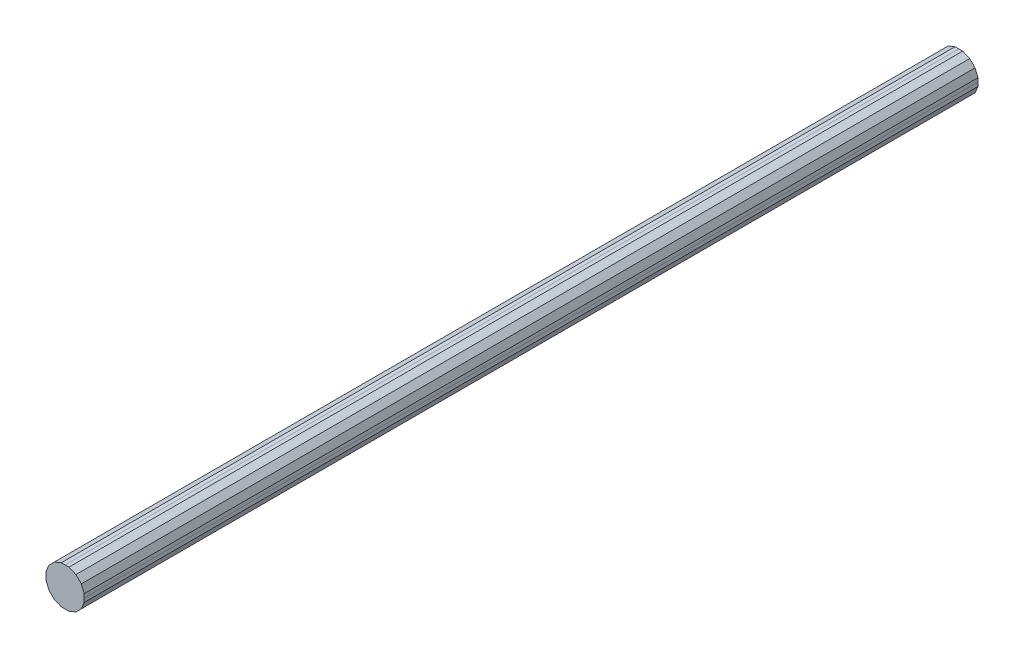
ISO-10303-21;
HEADER;
FILE_DESCRIPTION(('STEP AP214'),'2;1');
FILE_NAME('part.step','',(''),(''),'','','');
FILE_SCHEMA(('AUTOMOTIVE_DESIGN { 1 0 10303 214 1 1 1 1 }'));
ENDSEC;
DATA;
#1=APPLICATION_CONTEXT('core data for automotive mechanical design processes');
#2=APPLICATION_PROTOCOL_DEFINITION('international standard','automotive_design',2000,#1);
#3=PRODUCT_CONTEXT('',#1,'mechanical');
#4=PRODUCT('Part','Part','',(#3));
#5=PRODUCT_RELATED_PRODUCT_CATEGORY('part','',(#4));
#6=PRODUCT_DEFINITION_FORMATION('','',#4);
#7=PRODUCT_DEFINITION_CONTEXT('part definition',#1,'design');
#8=PRODUCT_DEFINITION('design','',#6,#7);
#9=PRODUCT_DEFINITION_SHAPE('','',#8);
#10=(LENGTH_UNIT() NAMED_UNIT(*) SI_UNIT(.MILLI.,.METRE.));
#11=(NAMED_UNIT(*) PLANE_ANGLE_UNIT() SI_UNIT($,.RADIAN.));
#12=(NAMED_UNIT(*) SI_UNIT($,.STERADIAN.) SOLID_ANGLE_UNIT());
#13=UNCERTAINTY_MEASURE_WITH_UNIT(LENGTH_MEASURE(1.E-05),#10,'distance_accuracy_value','');
#14=(GEOMETRIC_REPRESENTATION_CONTEXT(3) GLOBAL_UNCERTAINTY_ASSIGNED_CONTEXT((#13)) GLOBAL_UNIT_ASSIGNED_CONTEXT((#10,
#11,#12)) REPRESENTATION_CONTEXT('',''));
#15=CARTESIAN_POINT('',(0.,0.,0.));
#16=DIRECTION('',(0.,0.,1.));
#17=DIRECTION('',(1.,0.,0.));
#18=AXIS2_PLACEMENT_3D('',#15,#16,#17);
#19=CARTESIAN_POINT('',(0.,-0.2994914,13.99999994));
#20=DIRECTION('',(0.,0.,-1.));
#21=DIRECTION('',(0.,-1.,0.));
#22=AXIS2_PLACEMENT_3D('',#19,#20,#21);
#23=PLANE('',#22);
#24=DIRECTION('',(1.,0.,0.));
#25=VECTOR('',#24,1.);
#26=CARTESIAN_POINT('',(0.,-0.2994914,13.99999994));
#27=LINE('',#26,#25);
#28=CARTESIAN_POINT('',(0.,-0.2994914,13.99999994));
#29=VERTEX_POINT('',#28);
#30=CARTESIAN_POINT('',(0.05957062,-0.2994914,13.99999994));
#31=VERTEX_POINT('',#30);
#32=EDGE_CURVE('E239',#29,#31,#27,.T.);
#33=ORIENTED_EDGE('',*,*,#32,.T.);
#34=DIRECTION('',(0.923885359866117,0.382669363583048,0.));
#35=VECTOR('',#34,1.);
#36=CARTESIAN_POINT('',(0.05957062,-0.2994914,13.99999994));
#37=LINE('',#36,#35);
#38=CARTESIAN_POINT('',(0.1696466,-0.2538984,13.99999994));
#39=VERTEX_POINT('',#38);
#40=EDGE_CURVE('E227',#31,#39,#37,.T.);
#41=ORIENTED_EDGE('',*,*,#40,.T.);
#42=DIRECTION('',(0.707106781186048,0.707106781187048,0.));
#43=VECTOR('',#42,1.);
#44=CARTESIAN_POINT('',(0.1696466,-0.2538984,13.99999994));
#45=LINE('',#44,#43);
#46=CARTESIAN_POINT('',(0.25389586,-0.16964914,13.99999994));
#47=VERTEX_POINT('',#46);
#48=EDGE_CURVE('E269',#39,#47,#45,.T.);
#49=ORIENTED_EDGE('',*,*,#48,.T.);
#50=DIRECTION('',(0.382687560176932,0.923877822704835,0.));
#51=VECTOR('',#50,1.);
#52=CARTESIAN_POINT('',(0.25389586,-0.16964914,13.99999994));
#53=LINE('',#52,#51);
#54=CARTESIAN_POINT('',(0.2994914,-0.05957316,13.99999994));
#55=VERTEX_POINT('',#54);
#56=EDGE_CURVE('E163',#47,#55,#53,.T.);
#57=ORIENTED_EDGE('',*,*,#56,.T.);
#58=DIRECTION('',(0.,1.,0.));
#59=VECTOR('',#58,1.);
#60=CARTESIAN_POINT('',(0.2994914,-0.05957316,13.99999994));
#61=LINE('',#60,#59);
#62=CARTESIAN_POINT('',(0.2994914,0.,13.99999994));
#63=VERTEX_POINT('',#62);
#64=EDGE_CURVE('E317',#55,#63,#61,.T.);
#65=ORIENTED_EDGE('',*,*,#64,.T.);
#66=DIRECTION('',(0.,1.,0.));
#67=VECTOR('',#66,1.);
#68=CARTESIAN_POINT('',(0.2994914,0.,13.99999994));
#69=LINE('',#68,#67);
#70=CARTESIAN_POINT('',(0.2994914,0.05957061999999,13.99999994));
#71=VERTEX_POINT('',#70);
#72=EDGE_CURVE('E318',#63,#71,#69,.T.);
#73=ORIENTED_EDGE('',*,*,#72,.T.);
#74=DIRECTION('',(-0.382687560176932,0.923877822704835,0.));
#75=VECTOR('',#74,1.);
#76=CARTESIAN_POINT('',(0.2994914,0.05957061999999,13.99999994));
#77=LINE('',#76,#75);
#78=CARTESIAN_POINT('',(0.25389586,0.1696466,13.99999994));
#79=VERTEX_POINT('',#78);
#80=EDGE_CURVE('E305',#71,#79,#77,.T.);
#81=ORIENTED_EDGE('',*,*,#80,.T.);
#82=DIRECTION('',(-0.707106781186548,0.707106781186548,0.));
#83=VECTOR('',#82,1.);
#84=CARTESIAN_POINT('',(0.25389586,0.1696466,13.99999994));
#85=LINE('',#84,#83);
#86=CARTESIAN_POINT('',(0.1696466,0.25389586,13.99999994));
#87=VERTEX_POINT('',#86);
#88=EDGE_CURVE('E256',#79,#87,#85,.T.);
#89=ORIENTED_EDGE('',*,*,#88,.T.);
#90=DIRECTION('',(-0.923877822704835,0.382687560176932,0.));
#91=VECTOR('',#90,1.);
#92=CARTESIAN_POINT('',(0.1696466,0.25389586,13.99999994));
#93=LINE('',#92,#91);
#94=CARTESIAN_POINT('',(0.05957062,0.2994914,13.99999994));
#95=VERTEX_POINT('',#94);
#96=EDGE_CURVE('E291',#87,#95,#93,.T.);
#97=ORIENTED_EDGE('',*,*,#96,.T.);
#98=DIRECTION('',(-1.,0.,0.));
#99=VECTOR('',#98,1.);
#100=CARTESIAN_POINT('',(0.05957062,0.2994914,13.99999994));
#101=LINE('',#100,#99);
#102=CARTESIAN_POINT('',(0.,0.2994914,13.99999994));
#103=VERTEX_POINT('',#102);
#104=EDGE_CURVE('E270',#95,#103,#101,.T.);
#105=ORIENTED_EDGE('',*,*,#104,.T.);
#106=DIRECTION('',(-1.,0.,0.));
#107=VECTOR('',#106,1.);
#108=CARTESIAN_POINT('',(0.,0.2994914,13.99999994));
#109=LINE('',#108,#107);
#110=CARTESIAN_POINT('',(-0.05957316,0.2994914,13.99999994));
#111=VERTEX_POINT('',#110);
#112=EDGE_CURVE('E217',#103,#111,#109,.T.);
#113=ORIENTED_EDGE('',*,*,#112,.T.);
#114=DIRECTION('',(-0.923877822704835,-0.382687560176932,0.));
#115=VECTOR('',#114,1.);
#116=CARTESIAN_POINT('',(-0.05957316,0.2994914,13.99999994));
#117=LINE('',#116,#115);
#118=CARTESIAN_POINT('',(-0.16964914,0.25389586,13.99999994));
#119=VERTEX_POINT('',#118);
#120=EDGE_CURVE('E188',#111,#119,#117,.T.);
#121=ORIENTED_EDGE('',*,*,#120,.T.);
#122=DIRECTION('',(-0.707106781187048,-0.707106781186048,0.));
#123=VECTOR('',#122,1.);
#124=CARTESIAN_POINT('',(-0.16964914,0.25389586,13.99999994));
#125=LINE('',#124,#123);
#126=CARTESIAN_POINT('',(-0.2538984,0.1696466,13.99999994));
#127=VERTEX_POINT('',#126);
#128=EDGE_CURVE('E209',#119,#127,#125,.T.);
#129=ORIENTED_EDGE('',*,*,#128,.T.);
#130=DIRECTION('',(-0.382669363583048,-0.923885359866117,0.));
#131=VECTOR('',#130,1.);
#132=CARTESIAN_POINT('',(-0.2538984,0.1696466,13.99999994));
#133=LINE('',#132,#131);
#134=CARTESIAN_POINT('',(-0.2994914,0.05957061999999,13.99999994));
#135=VERTEX_POINT('',#134);
#136=EDGE_CURVE('E286',#127,#135,#133,.T.);
#137=ORIENTED_EDGE('',*,*,#136,.T.);
#138=DIRECTION('',(0.,-1.,0.));
#139=VECTOR('',#138,1.);
#140=CARTESIAN_POINT('',(-0.2994914,0.05957061999999,13.99999994));
#141=LINE('',#140,#139);
#142=CARTESIAN_POINT('',(-0.2994914,0.,13.99999994));
#143=VERTEX_POINT('',#142);
#144=EDGE_CURVE('E383',#135,#143,#141,.T.);
#145=ORIENTED_EDGE('',*,*,#144,.T.);
#146=DIRECTION('',(0.,-1.,0.));
#147=VECTOR('',#146,1.);
#148=CARTESIAN_POINT('',(-0.2994914,0.,13.99999994));
#149=LINE('',#148,#147);
#150=CARTESIAN_POINT('',(-0.2994914,-0.05957316,13.99999994));
#151=VERTEX_POINT('',#150);
#152=EDGE_CURVE('E375',#143,#151,#149,.T.);
#153=ORIENTED_EDGE('',*,*,#152,.T.);
#154=DIRECTION('',(0.382669363583048,-0.923885359866117,0.));
#155=VECTOR('',#154,1.);
#156=CARTESIAN_POINT('',(-0.2994914,-0.05957316,13.99999994));
#157=LINE('',#156,#155);
#158=CARTESIAN_POINT('',(-0.2538984,-0.16964914,13.99999994));
#159=VERTEX_POINT('',#158);
#160=EDGE_CURVE('E280',#151,#159,#157,.T.);
#161=ORIENTED_EDGE('',*,*,#160,.T.);
#162=DIRECTION('',(0.707106781186548,-0.707106781186548,0.));
#163=VECTOR('',#162,1.);
#164=CARTESIAN_POINT('',(-0.2538984,-0.16964914,13.99999994));
#165=LINE('',#164,#163);
#166=CARTESIAN_POINT('',(-0.16964914,-0.2538984,13.99999994));
#167=VERTEX_POINT('',#166);
#168=EDGE_CURVE('E251',#159,#167,#165,.T.);
#169=ORIENTED_EDGE('',*,*,#168,.T.);
#170=DIRECTION('',(0.923885359866117,-0.382669363583048,0.));
#171=VECTOR('',#170,1.);
#172=CARTESIAN_POINT('',(-0.16964914,-0.2538984,13.99999994));
#173=LINE('',#172,#171);
#174=CARTESIAN_POINT('',(-0.05957316,-0.2994914,13.99999994));
#175=VERTEX_POINT('',#174);
#176=EDGE_CURVE('E236',#167,#175,#173,.T.);
#177=ORIENTED_EDGE('',*,*,#176,.T.);
#178=DIRECTION('',(1.,0.,0.));
#179=VECTOR('',#178,1.);
#180=CARTESIAN_POINT('',(-0.05957316,-0.2994914,13.99999994));
#181=LINE('',#180,#179);
#182=EDGE_CURVE('E10',#175,#29,#181,.T.);
#183=ORIENTED_EDGE('',*,*,#182,.T.);
#184=EDGE_LOOP('',(#33,#41,#49,#57,#65,#73,#81,#89,#97,#105,#113,#121,#129,#137,#145,#153,#161,
#169,#177,#183));
#185=FACE_BOUND('',#184,.T.);
#186=ADVANCED_FACE('F16',(#185),#23,.F.);
#187=CARTESIAN_POINT('',(0.,-0.2994914,0.));
#188=DIRECTION('',(0.,0.,-1.));
#189=DIRECTION('',(0.,-1.,0.));
#190=AXIS2_PLACEMENT_3D('',#187,#188,#189);
#191=PLANE('',#190);
#192=DIRECTION('',(1.,0.,0.));
#193=VECTOR('',#192,1.);
#194=CARTESIAN_POINT('',(-0.05957316,-0.2994914,0.));
#195=LINE('',#194,#193);
#196=CARTESIAN_POINT('',(-0.05957316,-0.2994914,0.));
#197=VERTEX_POINT('',#196);
#198=CARTESIAN_POINT('',(0.,-0.2994914,0.));
#199=VERTEX_POINT('',#198);
#200=EDGE_CURVE('E27',#197,#199,#195,.T.);
#201=ORIENTED_EDGE('',*,*,#200,.F.);
#202=DIRECTION('',(0.923885359866117,-0.382669363583048,0.));
#203=VECTOR('',#202,1.);
#204=CARTESIAN_POINT('',(-0.16964914,-0.2538984,0.));
#205=LINE('',#204,#203);
#206=CARTESIAN_POINT('',(-0.16964914,-0.2538984,0.));
#207=VERTEX_POINT('',#206);
#208=EDGE_CURVE('E237',#207,#197,#205,.T.);
#209=ORIENTED_EDGE('',*,*,#208,.F.);
#210=DIRECTION('',(0.707106781186548,-0.707106781186548,0.));
#211=VECTOR('',#210,1.);
#212=CARTESIAN_POINT('',(-0.2538984,-0.16964914,0.));
#213=LINE('',#212,#211);
#214=CARTESIAN_POINT('',(-0.2538984,-0.16964914,0.));
#215=VERTEX_POINT('',#214);
#216=EDGE_CURVE('E276',#215,#207,#213,.T.);
#217=ORIENTED_EDGE('',*,*,#216,.F.);
#218=DIRECTION('',(0.382669363583048,-0.923885359866117,0.));
#219=VECTOR('',#218,1.);
#220=CARTESIAN_POINT('',(-0.2994914,-0.05957316,0.));
#221=LINE('',#220,#219);
#222=CARTESIAN_POINT('',(-0.2994914,-0.05957316,0.));
#223=VERTEX_POINT('',#222);
#224=EDGE_CURVE('E300',#223,#215,#221,.T.);
#225=ORIENTED_EDGE('',*,*,#224,.F.);
#226=DIRECTION('',(0.,-1.,0.));
#227=VECTOR('',#226,1.);
#228=CARTESIAN_POINT('',(-0.2994914,0.,0.));
#229=LINE('',#228,#227);
#230=CARTESIAN_POINT('',(-0.2994914,0.,0.));
#231=VERTEX_POINT('',#230);
#232=EDGE_CURVE('E376',#231,#223,#229,.T.);
#233=ORIENTED_EDGE('',*,*,#232,.F.);
#234=DIRECTION('',(0.,-1.,0.));
#235=VECTOR('',#234,1.);
#236=CARTESIAN_POINT('',(-0.2994914,0.05957061999999,0.));
#237=LINE('',#236,#235);
#238=CARTESIAN_POINT('',(-0.2994914,0.05957061999999,0.));
#239=VERTEX_POINT('',#238);
#240=EDGE_CURVE('E281',#239,#231,#237,.T.);
#241=ORIENTED_EDGE('',*,*,#240,.F.);
#242=DIRECTION('',(-0.382669363583048,-0.923885359866117,0.));
#243=VECTOR('',#242,1.);
#244=CARTESIAN_POINT('',(-0.2538984,0.1696466,0.));
#245=LINE('',#244,#243);
#246=CARTESIAN_POINT('',(-0.2538984,0.1696466,0.));
#247=VERTEX_POINT('',#246);
#248=EDGE_CURVE('E199',#247,#239,#245,.T.);
#249=ORIENTED_EDGE('',*,*,#248,.F.);
#250=DIRECTION('',(-0.707106781187048,-0.707106781186048,0.));
#251=VECTOR('',#250,1.);
#252=CARTESIAN_POINT('',(-0.16964914,0.25389586,0.));
#253=LINE('',#252,#251);
#254=CARTESIAN_POINT('',(-0.16964914,0.25389586,0.));
#255=VERTEX_POINT('',#254);
#256=EDGE_CURVE('E193',#255,#247,#253,.T.);
#257=ORIENTED_EDGE('',*,*,#256,.F.);
#258=DIRECTION('',(-0.923877822704835,-0.382687560176932,0.));
#259=VECTOR('',#258,1.);
#260=CARTESIAN_POINT('',(-0.05957316,0.2994914,0.));
#261=LINE('',#260,#259);
#262=CARTESIAN_POINT('',(-0.05957316,0.2994914,0.));
#263=VERTEX_POINT('',#262);
#264=EDGE_CURVE('E197',#263,#255,#261,.T.);
#265=ORIENTED_EDGE('',*,*,#264,.F.);
#266=DIRECTION('',(-1.,0.,0.));
#267=VECTOR('',#266,1.);
#268=CARTESIAN_POINT('',(0.,0.2994914,0.));
#269=LINE('',#268,#267);
#270=CARTESIAN_POINT('',(0.,0.2994914,0.));
#271=VERTEX_POINT('',#270);
#272=EDGE_CURVE('E274',#271,#263,#269,.T.);
#273=ORIENTED_EDGE('',*,*,#272,.F.);
#274=DIRECTION('',(-1.,0.,0.));
#275=VECTOR('',#274,1.);
#276=CARTESIAN_POINT('',(0.05957062,0.2994914,0.));
#277=LINE('',#276,#275);
#278=CARTESIAN_POINT('',(0.05957062,0.2994914,0.));
#279=VERTEX_POINT('',#278);
#280=EDGE_CURVE('E295',#279,#271,#277,.T.);
#281=ORIENTED_EDGE('',*,*,#280,.F.);
#282=DIRECTION('',(-0.923877822704835,0.382687560176932,0.));
#283=VECTOR('',#282,1.);
#284=CARTESIAN_POINT('',(0.1696466,0.25389586,0.));
#285=LINE('',#284,#283);
#286=CARTESIAN_POINT('',(0.1696466,0.25389586,0.));
#287=VERTEX_POINT('',#286);
#288=EDGE_CURVE('E260',#287,#279,#285,.T.);
#289=ORIENTED_EDGE('',*,*,#288,.F.);
#290=DIRECTION('',(-0.707106781186548,0.707106781186548,0.));
#291=VECTOR('',#290,1.);
#292=CARTESIAN_POINT('',(0.25389586,0.1696466,0.));
#293=LINE('',#292,#291);
#294=CARTESIAN_POINT('',(0.25389586,0.1696466,0.));
#295=VERTEX_POINT('',#294);
#296=EDGE_CURVE('E301',#295,#287,#293,.T.);
#297=ORIENTED_EDGE('',*,*,#296,.F.);
#298=DIRECTION('',(-0.382687560176932,0.923877822704835,0.));
#299=VECTOR('',#298,1.);
#300=CARTESIAN_POINT('',(0.2994914,0.05957061999999,0.));
#301=LINE('',#300,#299);
#302=CARTESIAN_POINT('',(0.2994914,0.05957061999999,0.));
#303=VERTEX_POINT('',#302);
#304=EDGE_CURVE('E322',#303,#295,#301,.T.);
#305=ORIENTED_EDGE('',*,*,#304,.F.);
#306=DIRECTION('',(0.,1.,0.));
#307=VECTOR('',#306,1.);
#308=CARTESIAN_POINT('',(0.2994914,0.,0.));
#309=LINE('',#308,#307);
#310=CARTESIAN_POINT('',(0.2994914,0.,0.));
#311=VERTEX_POINT('',#310);
#312=EDGE_CURVE('E312',#311,#303,#309,.T.);
#313=ORIENTED_EDGE('',*,*,#312,.F.);
#314=DIRECTION('',(0.,1.,0.));
#315=VECTOR('',#314,1.);
#316=CARTESIAN_POINT('',(0.2994914,-0.05957316,0.));
#317=LINE('',#316,#315);
#318=CARTESIAN_POINT('',(0.2994914,-0.05957316,0.));
#319=VERTEX_POINT('',#318);
#320=EDGE_CURVE('E351',#319,#311,#317,.T.);
#321=ORIENTED_EDGE('',*,*,#320,.F.);
#322=DIRECTION('',(0.382687560176932,0.923877822704835,0.));
#323=VECTOR('',#322,1.);
#324=CARTESIAN_POINT('',(0.25389586,-0.16964914,0.));
#325=LINE('',#324,#323);
#326=CARTESIAN_POINT('',(0.25389586,-0.16964914,0.));
#327=VERTEX_POINT('',#326);
#328=EDGE_CURVE('E173',#327,#319,#325,.T.);
#329=ORIENTED_EDGE('',*,*,#328,.F.);
#330=DIRECTION('',(0.707106781186048,0.707106781187048,0.));
#331=VECTOR('',#330,1.);
#332=CARTESIAN_POINT('',(0.1696466,-0.2538984,0.));
#333=LINE('',#332,#331);
#334=CARTESIAN_POINT('',(0.1696466,-0.2538984,0.));
#335=VERTEX_POINT('',#334);
#336=EDGE_CURVE('E230',#335,#327,#333,.T.);
#337=ORIENTED_EDGE('',*,*,#336,.F.);
#338=DIRECTION('',(0.923885359866117,0.382669363583048,0.));
#339=VECTOR('',#338,1.);
#340=CARTESIAN_POINT('',(0.05957062,-0.2994914,0.));
#341=LINE('',#340,#339);
#342=CARTESIAN_POINT('',(0.05957062,-0.2994914,0.));
#343=VERTEX_POINT('',#342);
#344=EDGE_CURVE('E323',#343,#335,#341,.T.);
#345=ORIENTED_EDGE('',*,*,#344,.F.);
#346=DIRECTION('',(1.,0.,0.));
#347=VECTOR('',#346,1.);
#348=CARTESIAN_POINT('',(0.,-0.2994914,0.));
#349=LINE('',#348,#347);
#350=EDGE_CURVE('E330',#199,#343,#349,.T.);
#351=ORIENTED_EDGE('',*,*,#350,.F.);
#352=EDGE_LOOP('',(#201,#209,#217,#225,#233,#241,#249,#257,#265,#273,#281,#289,#297,#305,#313,
#321,#329,#337,#345,#351));
#353=FACE_BOUND('',#352,.T.);
#354=ADVANCED_FACE('F195',(#353),#191,.T.);
#355=CARTESIAN_POINT('',(-0.05957316,-0.2994914,0.));
#356=DIRECTION('',(0.,1.,0.));
#357=DIRECTION('',(1.,0.,0.));
#358=AXIS2_PLACEMENT_3D('',#355,#356,#357);
#359=PLANE('',#358);
#360=ORIENTED_EDGE('',*,*,#200,.T.);
#361=DIRECTION('',(0.,0.,1.));
#362=VECTOR('',#361,1.);
#363=CARTESIAN_POINT('',(0.,-0.2994914,0.));
#364=LINE('',#363,#362);
#365=EDGE_CURVE('E243',#199,#29,#364,.T.);
#366=ORIENTED_EDGE('',*,*,#365,.T.);
#367=ORIENTED_EDGE('',*,*,#182,.F.);
#368=DIRECTION('',(0.,0.,1.));
#369=VECTOR('',#368,1.);
#370=CARTESIAN_POINT('',(-0.05957316,-0.2994914,0.));
#371=LINE('',#370,#369);
#372=EDGE_CURVE('E233',#197,#175,#371,.T.);
#373=ORIENTED_EDGE('',*,*,#372,.F.);
#374=EDGE_LOOP('',(#360,#366,#367,#373));
#375=FACE_BOUND('',#374,.T.);
#376=ADVANCED_FACE('F588',(#375),#359,.F.);
#377=CARTESIAN_POINT('',(-0.16964914,-0.2538984,0.));
#378=DIRECTION('',(0.382669363583048,0.923885359866117,0.));
#379=DIRECTION('',(0.,0.,-1.));
#380=AXIS2_PLACEMENT_3D('',#377,#378,#379);
#381=PLANE('',#380);
#382=ORIENTED_EDGE('',*,*,#208,.T.);
#383=ORIENTED_EDGE('',*,*,#372,.T.);
#384=ORIENTED_EDGE('',*,*,#176,.F.);
#385=DIRECTION('',(0.,0.,1.));
#386=VECTOR('',#385,1.);
#387=CARTESIAN_POINT('',(-0.16964914,-0.2538984,0.));
#388=LINE('',#387,#386);
#389=EDGE_CURVE('E255',#207,#167,#388,.T.);
#390=ORIENTED_EDGE('',*,*,#389,.F.);
#391=EDGE_LOOP('',(#382,#383,#384,#390));
#392=FACE_BOUND('',#391,.T.);
#393=ADVANCED_FACE('F593',(#392),#381,.F.);
#394=CARTESIAN_POINT('',(-0.2538984,-0.16964914,0.));
#395=DIRECTION('',(0.707106781186548,0.707106781186548,0.));
#396=DIRECTION('',(0.,0.,-1.));
#397=AXIS2_PLACEMENT_3D('',#394,#395,#396);
#398=PLANE('',#397);
#399=ORIENTED_EDGE('',*,*,#216,.T.);
#400=ORIENTED_EDGE('',*,*,#389,.T.);
#401=ORIENTED_EDGE('',*,*,#168,.F.);
#402=DIRECTION('',(0.,0.,1.));
#403=VECTOR('',#402,1.);
#404=CARTESIAN_POINT('',(-0.2538984,-0.16964914,0.));
#405=LINE('',#404,#403);
#406=EDGE_CURVE('E296',#215,#159,#405,.T.);
#407=ORIENTED_EDGE('',*,*,#406,.F.);
#408=EDGE_LOOP('',(#399,#400,#401,#407));
#409=FACE_BOUND('',#408,.T.);
#410=ADVANCED_FACE('F542',(#409),#398,.F.);
#411=CARTESIAN_POINT('',(-0.2994914,-0.05957316,0.));
#412=DIRECTION('',(0.923885359866117,0.382669363583048,0.));
#413=DIRECTION('',(0.,0.,-1.));
#414=AXIS2_PLACEMENT_3D('',#411,#412,#413);
#415=PLANE('',#414);
#416=ORIENTED_EDGE('',*,*,#224,.T.);
#417=ORIENTED_EDGE('',*,*,#406,.T.);
#418=ORIENTED_EDGE('',*,*,#160,.F.);
#419=DIRECTION('',(0.,0.,1.));
#420=VECTOR('',#419,1.);
#421=CARTESIAN_POINT('',(-0.2994914,-0.05957316,0.));
#422=LINE('',#421,#420);
#423=EDGE_CURVE('E371',#223,#151,#422,.T.);
#424=ORIENTED_EDGE('',*,*,#423,.F.);
#425=EDGE_LOOP('',(#416,#417,#418,#424));
#426=FACE_BOUND('',#425,.T.);
#427=ADVANCED_FACE('F432',(#426),#415,.F.);
#428=CARTESIAN_POINT('',(-0.2994914,0.,0.));
#429=DIRECTION('',(1.,0.,0.));
#430=DIRECTION('',(0.,1.,0.));
#431=AXIS2_PLACEMENT_3D('',#428,#429,#430);
#432=PLANE('',#431);
#433=ORIENTED_EDGE('',*,*,#232,.T.);
#434=ORIENTED_EDGE('',*,*,#423,.T.);
#435=ORIENTED_EDGE('',*,*,#152,.F.);
#436=DIRECTION('',(0.,0.,1.));
#437=VECTOR('',#436,1.);
#438=CARTESIAN_POINT('',(-0.2994914,0.,0.));
#439=LINE('',#438,#437);
#440=EDGE_CURVE('E285',#231,#143,#439,.T.);
#441=ORIENTED_EDGE('',*,*,#440,.F.);
#442=EDGE_LOOP('',(#433,#434,#435,#441));
#443=FACE_BOUND('',#442,.T.);
#444=ADVANCED_FACE('F429',(#443),#432,.F.);
#445=CARTESIAN_POINT('',(-0.2994914,0.05957061999999,0.));
#446=DIRECTION('',(1.,0.,0.));
#447=DIRECTION('',(0.,1.,0.));
#448=AXIS2_PLACEMENT_3D('',#445,#446,#447);
#449=PLANE('',#448);
#450=ORIENTED_EDGE('',*,*,#240,.T.);
#451=ORIENTED_EDGE('',*,*,#440,.T.);
#452=ORIENTED_EDGE('',*,*,#144,.F.);
#453=DIRECTION('',(0.,0.,1.));
#454=VECTOR('',#453,1.);
#455=CARTESIAN_POINT('',(-0.2994914,0.05957061999999,0.));
#456=LINE('',#455,#454);
#457=EDGE_CURVE('E287',#239,#135,#456,.T.);
#458=ORIENTED_EDGE('',*,*,#457,.F.);
#459=EDGE_LOOP('',(#450,#451,#452,#458));
#460=FACE_BOUND('',#459,.T.);
#461=ADVANCED_FACE('F551',(#460),#449,.F.);
#462=CARTESIAN_POINT('',(-0.2538984,0.1696466,0.));
#463=DIRECTION('',(0.923885359866117,-0.382669363583048,0.));
#464=DIRECTION('',(0.,0.,-1.));
#465=AXIS2_PLACEMENT_3D('',#462,#463,#464);
#466=PLANE('',#465);
#467=ORIENTED_EDGE('',*,*,#248,.T.);
#468=ORIENTED_EDGE('',*,*,#457,.T.);
#469=ORIENTED_EDGE('',*,*,#136,.F.);
#470=DIRECTION('',(0.,0.,1.));
#471=VECTOR('',#470,1.);
#472=CARTESIAN_POINT('',(-0.2538984,0.1696466,0.));
#473=LINE('',#472,#471);
#474=EDGE_CURVE('E204',#247,#127,#473,.T.);
#475=ORIENTED_EDGE('',*,*,#474,.F.);
#476=EDGE_LOOP('',(#467,#468,#469,#475));
#477=FACE_BOUND('',#476,.T.);
#478=ADVANCED_FACE('F611',(#477),#466,.F.);
#479=CARTESIAN_POINT('',(-0.16964914,0.25389586,0.));
#480=DIRECTION('',(0.707106781186048,-0.707106781187048,0.));
#481=DIRECTION('',(0.,0.,-1.));
#482=AXIS2_PLACEMENT_3D('',#479,#480,#481);
#483=PLANE('',#482);
#484=ORIENTED_EDGE('',*,*,#256,.T.);
#485=ORIENTED_EDGE('',*,*,#474,.T.);
#486=ORIENTED_EDGE('',*,*,#128,.F.);
#487=DIRECTION('',(0.,0.,1.));
#488=VECTOR('',#487,1.);
#489=CARTESIAN_POINT('',(-0.16964914,0.25389586,0.));
#490=LINE('',#489,#488);
#491=EDGE_CURVE('E206',#255,#119,#490,.T.);
#492=ORIENTED_EDGE('',*,*,#491,.F.);
#493=EDGE_LOOP('',(#484,#485,#486,#492));
#494=FACE_BOUND('',#493,.T.);
#495=ADVANCED_FACE('F207',(#494),#483,.F.);
#496=CARTESIAN_POINT('',(-0.05957316,0.2994914,0.));
#497=DIRECTION('',(0.382687560176932,-0.923877822704835,0.));
#498=DIRECTION('',(0.,0.,-1.));
#499=AXIS2_PLACEMENT_3D('',#496,#497,#498);
#500=PLANE('',#499);
#501=ORIENTED_EDGE('',*,*,#264,.T.);
#502=ORIENTED_EDGE('',*,*,#491,.T.);
#503=ORIENTED_EDGE('',*,*,#120,.F.);
#504=DIRECTION('',(0.,0.,1.));
#505=VECTOR('',#504,1.);
#506=CARTESIAN_POINT('',(-0.05957316,0.2994914,0.));
#507=LINE('',#506,#505);
#508=EDGE_CURVE('E214',#263,#111,#507,.T.);
#509=ORIENTED_EDGE('',*,*,#508,.F.);
#510=EDGE_LOOP('',(#501,#502,#503,#509));
#511=FACE_BOUND('',#510,.T.);
#512=ADVANCED_FACE('F212',(#511),#500,.F.);
#513=CARTESIAN_POINT('',(0.,0.2994914,0.));
#514=DIRECTION('',(0.,-1.,0.));
#515=DIRECTION('',(0.,0.,-1.));
#516=AXIS2_PLACEMENT_3D('',#513,#514,#515);
#517=PLANE('',#516);
#518=ORIENTED_EDGE('',*,*,#272,.T.);
#519=ORIENTED_EDGE('',*,*,#508,.T.);
#520=ORIENTED_EDGE('',*,*,#112,.F.);
#521=DIRECTION('',(0.,0.,1.));
#522=VECTOR('',#521,1.);
#523=CARTESIAN_POINT('',(0.,0.2994914,0.));
#524=LINE('',#523,#522);
#525=EDGE_CURVE('E275',#271,#103,#524,.T.);
#526=ORIENTED_EDGE('',*,*,#525,.F.);
#527=EDGE_LOOP('',(#518,#519,#520,#526));
#528=FACE_BOUND('',#527,.T.);
#529=ADVANCED_FACE('F598',(#528),#517,.F.);
#530=CARTESIAN_POINT('',(0.05957062,0.2994914,0.));
#531=DIRECTION('',(0.,-1.,0.));
#532=DIRECTION('',(0.,0.,-1.));
#533=AXIS2_PLACEMENT_3D('',#530,#531,#532);
#534=PLANE('',#533);
#535=ORIENTED_EDGE('',*,*,#280,.T.);
#536=ORIENTED_EDGE('',*,*,#525,.T.);
#537=ORIENTED_EDGE('',*,*,#104,.F.);
#538=DIRECTION('',(0.,0.,1.));
#539=VECTOR('',#538,1.);
#540=CARTESIAN_POINT('',(0.05957062,0.2994914,0.));
#541=LINE('',#540,#539);
#542=EDGE_CURVE('E20',#279,#95,#541,.T.);
#543=ORIENTED_EDGE('',*,*,#542,.F.);
#544=EDGE_LOOP('',(#535,#536,#537,#543));
#545=FACE_BOUND('',#544,.T.);
#546=ADVANCED_FACE('F452',(#545),#534,.F.);
#547=CARTESIAN_POINT('',(0.1696466,0.25389586,0.));
#548=DIRECTION('',(-0.382687560176932,-0.923877822704835,0.));
#549=DIRECTION('',(-0.923877822704835,0.382687560176932,0.));
#550=AXIS2_PLACEMENT_3D('',#547,#548,#549);
#551=PLANE('',#550);
#552=ORIENTED_EDGE('',*,*,#288,.T.);
#553=ORIENTED_EDGE('',*,*,#542,.T.);
#554=ORIENTED_EDGE('',*,*,#96,.F.);
#555=DIRECTION('',(0.,0.,1.));
#556=VECTOR('',#555,1.);
#557=CARTESIAN_POINT('',(0.1696466,0.25389586,0.));
#558=LINE('',#557,#556);
#559=EDGE_CURVE('E261',#287,#87,#558,.T.);
#560=ORIENTED_EDGE('',*,*,#559,.F.);
#561=EDGE_LOOP('',(#552,#553,#554,#560));
#562=FACE_BOUND('',#561,.T.);
#563=ADVANCED_FACE('F455',(#562),#551,.F.);
#564=CARTESIAN_POINT('',(0.25389586,0.1696466,0.));
#565=DIRECTION('',(-0.707106781186548,-0.707106781186548,0.));
#566=DIRECTION('',(-0.707106781186548,0.707106781186548,0.));
#567=AXIS2_PLACEMENT_3D('',#564,#565,#566);
#568=PLANE('',#567);
#569=ORIENTED_EDGE('',*,*,#296,.T.);
#570=ORIENTED_EDGE('',*,*,#559,.T.);
#571=ORIENTED_EDGE('',*,*,#88,.F.);
#572=DIRECTION('',(0.,0.,1.));
#573=VECTOR('',#572,1.);
#574=CARTESIAN_POINT('',(0.25389586,0.1696466,0.));
#575=LINE('',#574,#573);
#576=EDGE_CURVE('E226',#295,#79,#575,.T.);
#577=ORIENTED_EDGE('',*,*,#576,.F.);
#578=EDGE_LOOP('',(#569,#570,#571,#577));
#579=FACE_BOUND('',#578,.T.);
#580=ADVANCED_FACE('F458',(#579),#568,.F.);
#581=CARTESIAN_POINT('',(0.2994914,0.05957061999999,0.));
#582=DIRECTION('',(-0.923877822704835,-0.382687560176932,0.));
#583=DIRECTION('',(-0.382687560176932,0.923877822704835,0.));
#584=AXIS2_PLACEMENT_3D('',#581,#582,#583);
#585=PLANE('',#584);
#586=ORIENTED_EDGE('',*,*,#304,.T.);
#587=ORIENTED_EDGE('',*,*,#576,.T.);
#588=ORIENTED_EDGE('',*,*,#80,.F.);
#589=DIRECTION('',(0.,0.,1.));
#590=VECTOR('',#589,1.);
#591=CARTESIAN_POINT('',(0.2994914,0.05957061999999,0.));
#592=LINE('',#591,#590);
#593=EDGE_CURVE('E316',#303,#71,#592,.T.);
#594=ORIENTED_EDGE('',*,*,#593,.F.);
#595=EDGE_LOOP('',(#586,#587,#588,#594));
#596=FACE_BOUND('',#595,.T.);
#597=ADVANCED_FACE('F464',(#596),#585,.F.);
#598=CARTESIAN_POINT('',(0.2994914,0.,0.));
#599=DIRECTION('',(-1.,0.,0.));
#600=DIRECTION('',(0.,0.,1.));
#601=AXIS2_PLACEMENT_3D('',#598,#599,#600);
#602=PLANE('',#601);
#603=ORIENTED_EDGE('',*,*,#312,.T.);
#604=ORIENTED_EDGE('',*,*,#593,.T.);
#605=ORIENTED_EDGE('',*,*,#72,.F.);
#606=DIRECTION('',(0.,0.,1.));
#607=VECTOR('',#606,1.);
#608=CARTESIAN_POINT('',(0.2994914,0.,0.));
#609=LINE('',#608,#607);
#610=EDGE_CURVE('E340',#311,#63,#609,.T.);
#611=ORIENTED_EDGE('',*,*,#610,.F.);
#612=EDGE_LOOP('',(#603,#604,#605,#611));
#613=FACE_BOUND('',#612,.T.);
#614=ADVANCED_FACE('F466',(#613),#602,.F.);
#615=CARTESIAN_POINT('',(0.2994914,-0.05957316,0.));
#616=DIRECTION('',(-1.,0.,0.));
#617=DIRECTION('',(0.,0.,1.));
#618=AXIS2_PLACEMENT_3D('',#615,#616,#617);
#619=PLANE('',#618);
#620=ORIENTED_EDGE('',*,*,#320,.T.);
#621=ORIENTED_EDGE('',*,*,#610,.T.);
#622=ORIENTED_EDGE('',*,*,#64,.F.);
#623=DIRECTION('',(0.,0.,1.));
#624=VECTOR('',#623,1.);
#625=CARTESIAN_POINT('',(0.2994914,-0.05957316,0.));
#626=LINE('',#625,#624);
#627=EDGE_CURVE('E341',#319,#55,#626,.T.);
#628=ORIENTED_EDGE('',*,*,#627,.F.);
#629=EDGE_LOOP('',(#620,#621,#622,#628));
#630=FACE_BOUND('',#629,.T.);
#631=ADVANCED_FACE('F467',(#630),#619,.F.);
#632=CARTESIAN_POINT('',(0.25389586,-0.16964914,0.));
#633=DIRECTION('',(-0.923877822704835,0.382687560176932,0.));
#634=DIRECTION('',(0.,0.,1.));
#635=AXIS2_PLACEMENT_3D('',#632,#633,#634);
#636=PLANE('',#635);
#637=ORIENTED_EDGE('',*,*,#328,.T.);
#638=ORIENTED_EDGE('',*,*,#627,.T.);
#639=ORIENTED_EDGE('',*,*,#56,.F.);
#640=DIRECTION('',(0.,0.,1.));
#641=VECTOR('',#640,1.);
#642=CARTESIAN_POINT('',(0.25389586,-0.16964914,0.));
#643=LINE('',#642,#641);
#644=EDGE_CURVE('E265',#327,#47,#643,.T.);
#645=ORIENTED_EDGE('',*,*,#644,.F.);
#646=EDGE_LOOP('',(#637,#638,#639,#645));
#647=FACE_BOUND('',#646,.T.);
#648=ADVANCED_FACE('F567',(#647),#636,.F.);
#649=CARTESIAN_POINT('',(0.1696466,-0.2538984,0.));
#650=DIRECTION('',(-0.707106781187048,0.707106781186048,0.));
#651=DIRECTION('',(0.,0.,1.));
#652=AXIS2_PLACEMENT_3D('',#649,#650,#651);
#653=PLANE('',#652);
#654=ORIENTED_EDGE('',*,*,#336,.T.);
#655=ORIENTED_EDGE('',*,*,#644,.T.);
#656=ORIENTED_EDGE('',*,*,#48,.F.);
#657=DIRECTION('',(0.,0.,1.));
#658=VECTOR('',#657,1.);
#659=CARTESIAN_POINT('',(0.1696466,-0.2538984,0.));
#660=LINE('',#659,#658);
#661=EDGE_CURVE('E231',#335,#39,#660,.T.);
#662=ORIENTED_EDGE('',*,*,#661,.F.);
#663=EDGE_LOOP('',(#654,#655,#656,#662));
#664=FACE_BOUND('',#663,.T.);
#665=ADVANCED_FACE('F18',(#664),#653,.F.);
#666=CARTESIAN_POINT('',(0.05957062,-0.2994914,0.));
#667=DIRECTION('',(-0.382669363583048,0.923885359866117,0.));
#668=DIRECTION('',(0.,0.,1.));
#669=AXIS2_PLACEMENT_3D('',#666,#667,#668);
#670=PLANE('',#669);
#671=ORIENTED_EDGE('',*,*,#344,.T.);
#672=ORIENTED_EDGE('',*,*,#661,.T.);
#673=ORIENTED_EDGE('',*,*,#40,.F.);
#674=DIRECTION('',(0.,0.,1.));
#675=VECTOR('',#674,1.);
#676=CARTESIAN_POINT('',(0.05957062,-0.2994914,0.));
#677=LINE('',#676,#675);
#678=EDGE_CURVE('E244',#343,#31,#677,.T.);
#679=ORIENTED_EDGE('',*,*,#678,.F.);
#680=EDGE_LOOP('',(#671,#672,#673,#679));
#681=FACE_BOUND('',#680,.T.);
#682=ADVANCED_FACE('F516',(#681),#670,.F.);
#683=CARTESIAN_POINT('',(0.,-0.2994914,0.));
#684=DIRECTION('',(0.,1.,0.));
#685=DIRECTION('',(1.,0.,0.));
#686=AXIS2_PLACEMENT_3D('',#683,#684,#685);
#687=PLANE('',#686);
#688=ORIENTED_EDGE('',*,*,#350,.T.);
#689=ORIENTED_EDGE('',*,*,#678,.T.);
#690=ORIENTED_EDGE('',*,*,#32,.F.);
#691=ORIENTED_EDGE('',*,*,#365,.F.);
#692=EDGE_LOOP('',(#688,#689,#690,#691));
#693=FACE_BOUND('',#692,.T.);
#694=ADVANCED_FACE('F511',(#693),#687,.F.);
#695=CLOSED_SHELL('',(#186,#354,#376,#393,#410,#427,#444,#461,#478,#495,#512,#529,#546,#563,
#580,#597,#614,#631,#648,#665,#682,#694));
#696=MANIFOLD_SOLID_BREP('B1',#695);
#697=ADVANCED_BREP_SHAPE_REPRESENTATION('',(#18,#696),#14);
#698=SHAPE_DEFINITION_REPRESENTATION(#9,#697);
ENDSEC;
END-ISO-10303-21;
